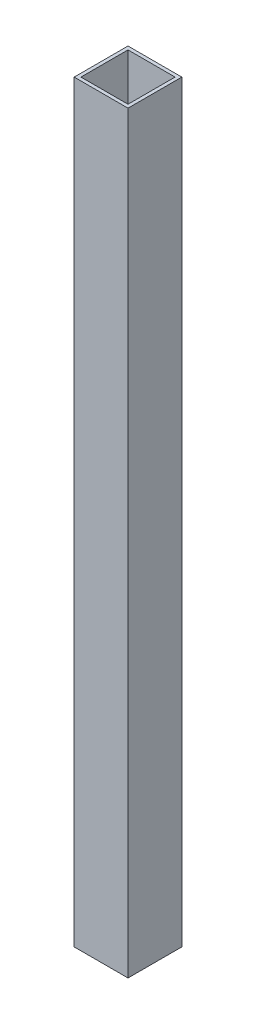
ISO-10303-21;
HEADER;
FILE_DESCRIPTION(('STEP AP214'),'2;1');
FILE_NAME('part.step','',(''),(''),'','','');
FILE_SCHEMA(('AUTOMOTIVE_DESIGN { 1 0 10303 214 1 1 1 1 }'));
ENDSEC;
DATA;
#1=APPLICATION_CONTEXT('core data for automotive mechanical design processes');
#2=APPLICATION_PROTOCOL_DEFINITION('international standard','automotive_design',2000,#1);
#3=PRODUCT_CONTEXT('',#1,'mechanical');
#4=PRODUCT('Part','Part','',(#3));
#5=PRODUCT_RELATED_PRODUCT_CATEGORY('part','',(#4));
#6=PRODUCT_DEFINITION_FORMATION('','',#4);
#7=PRODUCT_DEFINITION_CONTEXT('part definition',#1,'design');
#8=PRODUCT_DEFINITION('design','',#6,#7);
#9=PRODUCT_DEFINITION_SHAPE('','',#8);
#10=(LENGTH_UNIT() NAMED_UNIT(*) SI_UNIT(.MILLI.,.METRE.));
#11=(NAMED_UNIT(*) PLANE_ANGLE_UNIT() SI_UNIT($,.RADIAN.));
#12=(NAMED_UNIT(*) SI_UNIT($,.STERADIAN.) SOLID_ANGLE_UNIT());
#13=UNCERTAINTY_MEASURE_WITH_UNIT(LENGTH_MEASURE(1.E-05),#10,'distance_accuracy_value','');
#14=(GEOMETRIC_REPRESENTATION_CONTEXT(3) GLOBAL_UNCERTAINTY_ASSIGNED_CONTEXT((#13)) GLOBAL_UNIT_ASSIGNED_CONTEXT((#10,
#11,#12)) REPRESENTATION_CONTEXT('',''));
#15=CARTESIAN_POINT('',(0.,0.,0.));
#16=DIRECTION('',(0.,0.,1.));
#17=DIRECTION('',(1.,0.,0.));
#18=AXIS2_PLACEMENT_3D('',#15,#16,#17);
#19=CARTESIAN_POINT('',(0.,355.6,0.));
#20=DIRECTION('',(0.,-1.,0.));
#21=DIRECTION('',(0.,0.,-1.));
#22=AXIS2_PLACEMENT_3D('',#19,#20,#21);
#23=PLANE('',#22);
#24=DIRECTION('',(0.,0.,1.));
#25=VECTOR('',#24,1.);
#26=CARTESIAN_POINT('',(-12.7,355.6,-12.7));
#27=LINE('',#26,#25);
#28=CARTESIAN_POINT('',(-12.7,355.6,-12.7));
#29=VERTEX_POINT('',#28);
#30=CARTESIAN_POINT('',(-12.7,355.6,12.7));
#31=VERTEX_POINT('',#30);
#32=EDGE_CURVE('E138',#29,#31,#27,.T.);
#33=ORIENTED_EDGE('',*,*,#32,.T.);
#34=DIRECTION('',(1.,0.,0.));
#35=VECTOR('',#34,1.);
#36=CARTESIAN_POINT('',(12.7,355.6,12.7));
#37=LINE('',#36,#35);
#38=CARTESIAN_POINT('',(12.7,355.6,12.7));
#39=VERTEX_POINT('',#38);
#40=EDGE_CURVE('E141',#31,#39,#37,.T.);
#41=ORIENTED_EDGE('',*,*,#40,.T.);
#42=DIRECTION('',(0.,0.,-1.));
#43=VECTOR('',#42,1.);
#44=CARTESIAN_POINT('',(12.7,355.6,-12.7));
#45=LINE('',#44,#43);
#46=CARTESIAN_POINT('',(12.7,355.6,-12.7));
#47=VERTEX_POINT('',#46);
#48=EDGE_CURVE('E144',#39,#47,#45,.T.);
#49=ORIENTED_EDGE('',*,*,#48,.T.);
#50=DIRECTION('',(-1.,0.,0.));
#51=VECTOR('',#50,1.);
#52=CARTESIAN_POINT('',(12.7,355.6,-12.7));
#53=LINE('',#52,#51);
#54=EDGE_CURVE('E146',#47,#29,#53,.T.);
#55=ORIENTED_EDGE('',*,*,#54,.T.);
#56=EDGE_LOOP('',(#33,#41,#49,#55));
#57=FACE_BOUND('',#56,.T.);
#58=DIRECTION('',(-1.,0.,0.));
#59=VECTOR('',#58,1.);
#60=CARTESIAN_POINT('',(11.1125,355.6,-11.1125));
#61=LINE('',#60,#59);
#62=CARTESIAN_POINT('',(11.1125,355.6,-11.1125));
#63=VERTEX_POINT('',#62);
#64=CARTESIAN_POINT('',(-11.1125,355.6,-11.1125));
#65=VERTEX_POINT('',#64);
#66=EDGE_CURVE('E102',#63,#65,#61,.T.);
#67=ORIENTED_EDGE('',*,*,#66,.F.);
#68=DIRECTION('',(0.,0.,-1.));
#69=VECTOR('',#68,1.);
#70=CARTESIAN_POINT('',(11.1125,355.6,-11.1125));
#71=LINE('',#70,#69);
#72=CARTESIAN_POINT('',(11.1125,355.6,11.1125));
#73=VERTEX_POINT('',#72);
#74=EDGE_CURVE('E124',#73,#63,#71,.T.);
#75=ORIENTED_EDGE('',*,*,#74,.F.);
#76=DIRECTION('',(1.,0.,0.));
#77=VECTOR('',#76,1.);
#78=CARTESIAN_POINT('',(11.1125,355.6,11.1125));
#79=LINE('',#78,#77);
#80=CARTESIAN_POINT('',(-11.1125,355.6,11.1125));
#81=VERTEX_POINT('',#80);
#82=EDGE_CURVE('E122',#81,#73,#79,.T.);
#83=ORIENTED_EDGE('',*,*,#82,.F.);
#84=DIRECTION('',(0.,0.,1.));
#85=VECTOR('',#84,1.);
#86=CARTESIAN_POINT('',(-11.1125,355.6,-11.1125));
#87=LINE('',#86,#85);
#88=EDGE_CURVE('E110',#65,#81,#87,.T.);
#89=ORIENTED_EDGE('',*,*,#88,.F.);
#90=EDGE_LOOP('',(#67,#75,#83,#89));
#91=FACE_BOUND('',#90,.T.);
#92=ADVANCED_FACE('F37',(#57,#91),#23,.F.);
#93=CARTESIAN_POINT('',(0.,0.,0.));
#94=DIRECTION('',(0.,-1.,0.));
#95=DIRECTION('',(0.,0.,-1.));
#96=AXIS2_PLACEMENT_3D('',#93,#94,#95);
#97=PLANE('',#96);
#98=DIRECTION('',(0.,0.,1.));
#99=VECTOR('',#98,1.);
#100=CARTESIAN_POINT('',(-12.7,0.,-12.7));
#101=LINE('',#100,#99);
#102=CARTESIAN_POINT('',(-12.7,0.,-12.7));
#103=VERTEX_POINT('',#102);
#104=CARTESIAN_POINT('',(-12.7,0.,12.7));
#105=VERTEX_POINT('',#104);
#106=EDGE_CURVE('E118',#103,#105,#101,.T.);
#107=ORIENTED_EDGE('',*,*,#106,.F.);
#108=DIRECTION('',(-1.,0.,0.));
#109=VECTOR('',#108,1.);
#110=CARTESIAN_POINT('',(12.7,0.,-12.7));
#111=LINE('',#110,#109);
#112=CARTESIAN_POINT('',(12.7,0.,-12.7));
#113=VERTEX_POINT('',#112);
#114=EDGE_CURVE('E142',#113,#103,#111,.T.);
#115=ORIENTED_EDGE('',*,*,#114,.F.);
#116=DIRECTION('',(0.,0.,-1.));
#117=VECTOR('',#116,1.);
#118=CARTESIAN_POINT('',(12.7,0.,-12.7));
#119=LINE('',#118,#117);
#120=CARTESIAN_POINT('',(12.7,0.,12.7));
#121=VERTEX_POINT('',#120);
#122=EDGE_CURVE('E153',#121,#113,#119,.T.);
#123=ORIENTED_EDGE('',*,*,#122,.F.);
#124=DIRECTION('',(1.,0.,0.));
#125=VECTOR('',#124,1.);
#126=CARTESIAN_POINT('',(12.7,0.,12.7));
#127=LINE('',#126,#125);
#128=EDGE_CURVE('E151',#105,#121,#127,.T.);
#129=ORIENTED_EDGE('',*,*,#128,.F.);
#130=EDGE_LOOP('',(#107,#115,#123,#129));
#131=FACE_BOUND('',#130,.T.);
#132=DIRECTION('',(0.,0.,-1.));
#133=VECTOR('',#132,1.);
#134=CARTESIAN_POINT('',(11.1125,0.,-11.1125));
#135=LINE('',#134,#133);
#136=CARTESIAN_POINT('',(11.1125,0.,11.1125));
#137=VERTEX_POINT('',#136);
#138=CARTESIAN_POINT('',(11.1125,0.,-11.1125));
#139=VERTEX_POINT('',#138);
#140=EDGE_CURVE('E111',#137,#139,#135,.T.);
#141=ORIENTED_EDGE('',*,*,#140,.T.);
#142=DIRECTION('',(-1.,0.,0.));
#143=VECTOR('',#142,1.);
#144=CARTESIAN_POINT('',(11.1125,0.,-11.1125));
#145=LINE('',#144,#143);
#146=CARTESIAN_POINT('',(-11.1125,0.,-11.1125));
#147=VERTEX_POINT('',#146);
#148=EDGE_CURVE('E60',#139,#147,#145,.T.);
#149=ORIENTED_EDGE('',*,*,#148,.T.);
#150=DIRECTION('',(0.,0.,1.));
#151=VECTOR('',#150,1.);
#152=CARTESIAN_POINT('',(-11.1125,0.,-11.1125));
#153=LINE('',#152,#151);
#154=CARTESIAN_POINT('',(-11.1125,0.,11.1125));
#155=VERTEX_POINT('',#154);
#156=EDGE_CURVE('E117',#147,#155,#153,.T.);
#157=ORIENTED_EDGE('',*,*,#156,.T.);
#158=DIRECTION('',(1.,0.,0.));
#159=VECTOR('',#158,1.);
#160=CARTESIAN_POINT('',(11.1125,0.,11.1125));
#161=LINE('',#160,#159);
#162=EDGE_CURVE('E130',#155,#137,#161,.T.);
#163=ORIENTED_EDGE('',*,*,#162,.T.);
#164=EDGE_LOOP('',(#141,#149,#157,#163));
#165=FACE_BOUND('',#164,.T.);
#166=ADVANCED_FACE('F172',(#131,#165),#97,.T.);
#167=CARTESIAN_POINT('',(-12.7,355.6,-12.7));
#168=DIRECTION('',(1.,0.,0.));
#169=DIRECTION('',(0.,0.,-1.));
#170=AXIS2_PLACEMENT_3D('',#167,#168,#169);
#171=PLANE('',#170);
#172=ORIENTED_EDGE('',*,*,#106,.T.);
#173=DIRECTION('',(0.,-1.,0.));
#174=VECTOR('',#173,1.);
#175=CARTESIAN_POINT('',(-12.7,355.6,12.7));
#176=LINE('',#175,#174);
#177=EDGE_CURVE('E11',#31,#105,#176,.T.);
#178=ORIENTED_EDGE('',*,*,#177,.F.);
#179=ORIENTED_EDGE('',*,*,#32,.F.);
#180=DIRECTION('',(0.,-1.,0.));
#181=VECTOR('',#180,1.);
#182=CARTESIAN_POINT('',(-12.7,355.6,-12.7));
#183=LINE('',#182,#181);
#184=EDGE_CURVE('E148',#29,#103,#183,.T.);
#185=ORIENTED_EDGE('',*,*,#184,.T.);
#186=EDGE_LOOP('',(#172,#178,#179,#185));
#187=FACE_BOUND('',#186,.T.);
#188=ADVANCED_FACE('F39',(#187),#171,.F.);
#189=CARTESIAN_POINT('',(12.7,355.6,12.7));
#190=DIRECTION('',(0.,0.,-1.));
#191=DIRECTION('',(-1.,0.,0.));
#192=AXIS2_PLACEMENT_3D('',#189,#190,#191);
#193=PLANE('',#192);
#194=ORIENTED_EDGE('',*,*,#128,.T.);
#195=DIRECTION('',(0.,-1.,0.));
#196=VECTOR('',#195,1.);
#197=CARTESIAN_POINT('',(12.7,355.6,12.7));
#198=LINE('',#197,#196);
#199=EDGE_CURVE('E45',#39,#121,#198,.T.);
#200=ORIENTED_EDGE('',*,*,#199,.F.);
#201=ORIENTED_EDGE('',*,*,#40,.F.);
#202=ORIENTED_EDGE('',*,*,#177,.T.);
#203=EDGE_LOOP('',(#194,#200,#201,#202));
#204=FACE_BOUND('',#203,.T.);
#205=ADVANCED_FACE('F182',(#204),#193,.F.);
#206=CARTESIAN_POINT('',(12.7,355.6,-12.7));
#207=DIRECTION('',(-1.,0.,0.));
#208=DIRECTION('',(0.,0.,1.));
#209=AXIS2_PLACEMENT_3D('',#206,#207,#208);
#210=PLANE('',#209);
#211=ORIENTED_EDGE('',*,*,#122,.T.);
#212=DIRECTION('',(0.,-1.,0.));
#213=VECTOR('',#212,1.);
#214=CARTESIAN_POINT('',(12.7,355.6,-12.7));
#215=LINE('',#214,#213);
#216=EDGE_CURVE('E158',#47,#113,#215,.T.);
#217=ORIENTED_EDGE('',*,*,#216,.F.);
#218=ORIENTED_EDGE('',*,*,#48,.F.);
#219=ORIENTED_EDGE('',*,*,#199,.T.);
#220=EDGE_LOOP('',(#211,#217,#218,#219));
#221=FACE_BOUND('',#220,.T.);
#222=ADVANCED_FACE('F166',(#221),#210,.F.);
#223=CARTESIAN_POINT('',(12.7,355.6,-12.7));
#224=DIRECTION('',(0.,0.,1.));
#225=DIRECTION('',(1.,0.,0.));
#226=AXIS2_PLACEMENT_3D('',#223,#224,#225);
#227=PLANE('',#226);
#228=ORIENTED_EDGE('',*,*,#114,.T.);
#229=ORIENTED_EDGE('',*,*,#184,.F.);
#230=ORIENTED_EDGE('',*,*,#54,.F.);
#231=ORIENTED_EDGE('',*,*,#216,.T.);
#232=EDGE_LOOP('',(#228,#229,#230,#231));
#233=FACE_BOUND('',#232,.T.);
#234=ADVANCED_FACE('F176',(#233),#227,.F.);
#235=CARTESIAN_POINT('',(11.1125,355.6,-11.1125));
#236=DIRECTION('',(0.,0.,1.));
#237=DIRECTION('',(1.,0.,0.));
#238=AXIS2_PLACEMENT_3D('',#235,#236,#237);
#239=PLANE('',#238);
#240=ORIENTED_EDGE('',*,*,#148,.F.);
#241=DIRECTION('',(0.,-1.,0.));
#242=VECTOR('',#241,1.);
#243=CARTESIAN_POINT('',(11.1125,355.6,-11.1125));
#244=LINE('',#243,#242);
#245=EDGE_CURVE('E106',#63,#139,#244,.T.);
#246=ORIENTED_EDGE('',*,*,#245,.F.);
#247=ORIENTED_EDGE('',*,*,#66,.T.);
#248=DIRECTION('',(0.,-1.,0.));
#249=VECTOR('',#248,1.);
#250=CARTESIAN_POINT('',(-11.1125,355.6,-11.1125));
#251=LINE('',#250,#249);
#252=EDGE_CURVE('E105',#65,#147,#251,.T.);
#253=ORIENTED_EDGE('',*,*,#252,.T.);
#254=EDGE_LOOP('',(#240,#246,#247,#253));
#255=FACE_BOUND('',#254,.T.);
#256=ADVANCED_FACE('F104',(#255),#239,.T.);
#257=CARTESIAN_POINT('',(-11.1125,355.6,-11.1125));
#258=DIRECTION('',(1.,0.,0.));
#259=DIRECTION('',(0.,0.,-1.));
#260=AXIS2_PLACEMENT_3D('',#257,#258,#259);
#261=PLANE('',#260);
#262=ORIENTED_EDGE('',*,*,#156,.F.);
#263=ORIENTED_EDGE('',*,*,#252,.F.);
#264=ORIENTED_EDGE('',*,*,#88,.T.);
#265=DIRECTION('',(0.,-1.,0.));
#266=VECTOR('',#265,1.);
#267=CARTESIAN_POINT('',(-11.1125,355.6,11.1125));
#268=LINE('',#267,#266);
#269=EDGE_CURVE('E119',#81,#155,#268,.T.);
#270=ORIENTED_EDGE('',*,*,#269,.T.);
#271=EDGE_LOOP('',(#262,#263,#264,#270));
#272=FACE_BOUND('',#271,.T.);
#273=ADVANCED_FACE('F114',(#272),#261,.T.);
#274=CARTESIAN_POINT('',(11.1125,355.6,11.1125));
#275=DIRECTION('',(0.,0.,-1.));
#276=DIRECTION('',(-1.,0.,0.));
#277=AXIS2_PLACEMENT_3D('',#274,#275,#276);
#278=PLANE('',#277);
#279=ORIENTED_EDGE('',*,*,#162,.F.);
#280=ORIENTED_EDGE('',*,*,#269,.F.);
#281=ORIENTED_EDGE('',*,*,#82,.T.);
#282=DIRECTION('',(0.,-1.,0.));
#283=VECTOR('',#282,1.);
#284=CARTESIAN_POINT('',(11.1125,355.6,11.1125));
#285=LINE('',#284,#283);
#286=EDGE_CURVE('E52',#73,#137,#285,.T.);
#287=ORIENTED_EDGE('',*,*,#286,.T.);
#288=EDGE_LOOP('',(#279,#280,#281,#287));
#289=FACE_BOUND('',#288,.T.);
#290=ADVANCED_FACE('F205',(#289),#278,.T.);
#291=CARTESIAN_POINT('',(11.1125,355.6,-11.1125));
#292=DIRECTION('',(-1.,0.,0.));
#293=DIRECTION('',(0.,0.,1.));
#294=AXIS2_PLACEMENT_3D('',#291,#292,#293);
#295=PLANE('',#294);
#296=ORIENTED_EDGE('',*,*,#140,.F.);
#297=ORIENTED_EDGE('',*,*,#286,.F.);
#298=ORIENTED_EDGE('',*,*,#74,.T.);
#299=ORIENTED_EDGE('',*,*,#245,.T.);
#300=EDGE_LOOP('',(#296,#297,#298,#299));
#301=FACE_BOUND('',#300,.T.);
#302=ADVANCED_FACE('F209',(#301),#295,.T.);
#303=CLOSED_SHELL('',(#92,#166,#188,#205,#222,#234,#256,#273,#290,#302));
#304=MANIFOLD_SOLID_BREP('B2',#303);
#305=ADVANCED_BREP_SHAPE_REPRESENTATION('',(#18,#304),#14);
#306=SHAPE_DEFINITION_REPRESENTATION(#9,#305);
ENDSEC;
END-ISO-10303-21;
